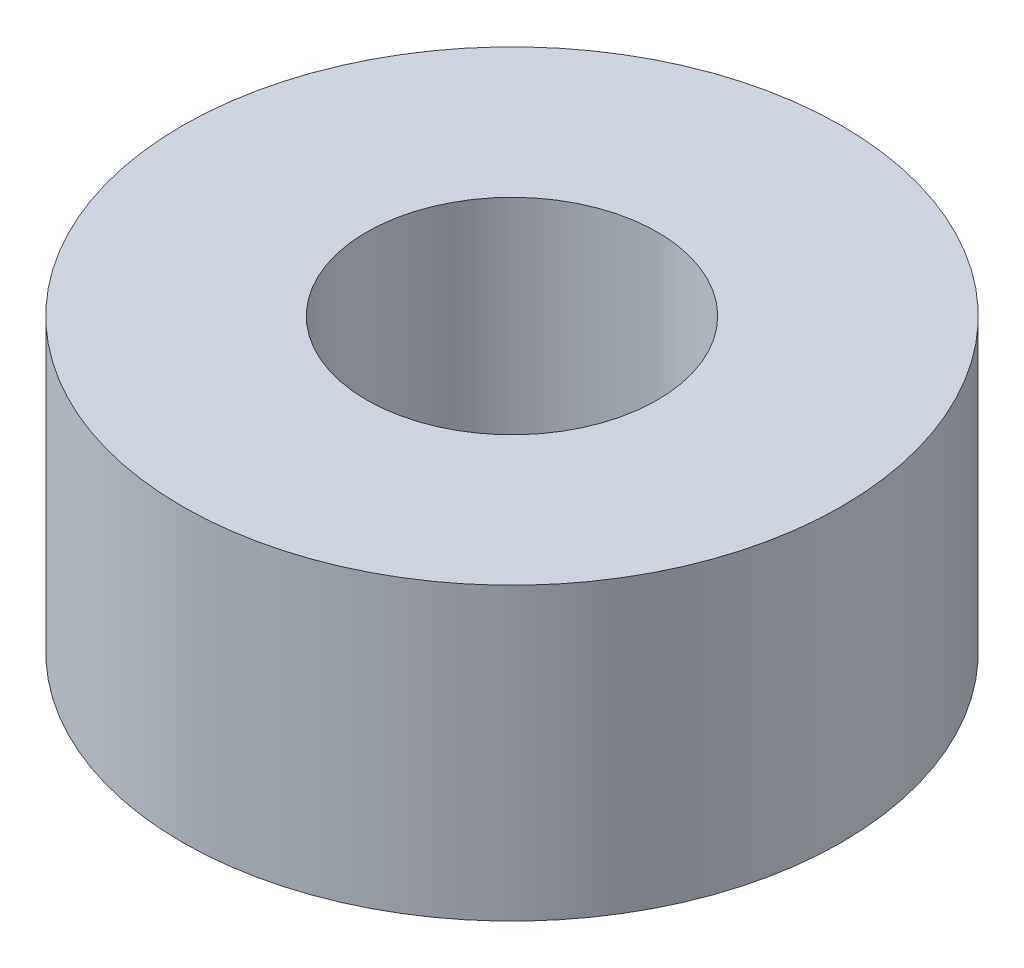
ISO-10303-21;
HEADER;
FILE_DESCRIPTION(('STEP AP214'),'2;1');
FILE_NAME('part.step','',(''),(''),'','','');
FILE_SCHEMA(('AUTOMOTIVE_DESIGN { 1 0 10303 214 1 1 1 1 }'));
ENDSEC;
DATA;
#1=APPLICATION_CONTEXT('core data for automotive mechanical design processes');
#2=APPLICATION_PROTOCOL_DEFINITION('international standard','automotive_design',2000,#1);
#3=PRODUCT_CONTEXT('',#1,'mechanical');
#4=PRODUCT('Part','Part','',(#3));
#5=PRODUCT_RELATED_PRODUCT_CATEGORY('part','',(#4));
#6=PRODUCT_DEFINITION_FORMATION('','',#4);
#7=PRODUCT_DEFINITION_CONTEXT('part definition',#1,'design');
#8=PRODUCT_DEFINITION('design','',#6,#7);
#9=PRODUCT_DEFINITION_SHAPE('','',#8);
#10=(LENGTH_UNIT() NAMED_UNIT(*) SI_UNIT(.MILLI.,.METRE.));
#11=(NAMED_UNIT(*) PLANE_ANGLE_UNIT() SI_UNIT($,.RADIAN.));
#12=(NAMED_UNIT(*) SI_UNIT($,.STERADIAN.) SOLID_ANGLE_UNIT());
#13=UNCERTAINTY_MEASURE_WITH_UNIT(LENGTH_MEASURE(1.E-05),#10,'distance_accuracy_value','');
#14=(GEOMETRIC_REPRESENTATION_CONTEXT(3) GLOBAL_UNCERTAINTY_ASSIGNED_CONTEXT((#13)) GLOBAL_UNIT_ASSIGNED_CONTEXT((#10,
#11,#12)) REPRESENTATION_CONTEXT('',''));
#15=CARTESIAN_POINT('',(0.,0.,0.));
#16=DIRECTION('',(0.,0.,1.));
#17=DIRECTION('',(1.,0.,0.));
#18=AXIS2_PLACEMENT_3D('',#15,#16,#17);
#19=CARTESIAN_POINT('',(0.,3.,0.));
#20=DIRECTION('',(0.,1.,0.));
#21=DIRECTION('',(0.,0.,1.));
#22=AXIS2_PLACEMENT_3D('',#19,#20,#21);
#23=PLANE('',#22);
#24=CARTESIAN_POINT('',(0.,3.,0.));
#25=DIRECTION('',(0.,1.,0.));
#26=DIRECTION('',(0.,0.,1.));
#27=AXIS2_PLACEMENT_3D('',#24,#25,#26);
#28=CIRCLE('',#27,3.4);
#29=CARTESIAN_POINT('',(0.,3.,3.4));
#30=VERTEX_POINT('',#29);
#31=EDGE_CURVE('E10',#30,#30,#28,.T.);
#32=ORIENTED_EDGE('',*,*,#31,.T.);
#33=EDGE_LOOP('',(#32));
#34=FACE_BOUND('',#33,.T.);
#35=CARTESIAN_POINT('',(0.,3.,0.));
#36=DIRECTION('',(0.,1.,0.));
#37=DIRECTION('',(0.,0.,1.));
#38=AXIS2_PLACEMENT_3D('',#35,#36,#37);
#39=CIRCLE('',#38,1.5);
#40=CARTESIAN_POINT('',(0.,3.,1.5));
#41=VERTEX_POINT('',#40);
#42=EDGE_CURVE('E43',#41,#41,#39,.T.);
#43=ORIENTED_EDGE('',*,*,#42,.F.);
#44=EDGE_LOOP('',(#43));
#45=FACE_BOUND('',#44,.T.);
#46=ADVANCED_FACE('F32',(#34,#45),#23,.T.);
#47=CARTESIAN_POINT('',(0.,0.,0.));
#48=DIRECTION('',(0.,1.,0.));
#49=DIRECTION('',(0.,0.,1.));
#50=AXIS2_PLACEMENT_3D('',#47,#48,#49);
#51=PLANE('',#50);
#52=CARTESIAN_POINT('',(0.,0.,0.));
#53=DIRECTION('',(0.,1.,0.));
#54=DIRECTION('',(0.,0.,1.));
#55=AXIS2_PLACEMENT_3D('',#52,#53,#54);
#56=CIRCLE('',#55,3.4);
#57=CARTESIAN_POINT('',(0.,0.,3.4));
#58=VERTEX_POINT('',#57);
#59=EDGE_CURVE('E36',#58,#58,#56,.T.);
#60=ORIENTED_EDGE('',*,*,#59,.F.);
#61=EDGE_LOOP('',(#60));
#62=FACE_BOUND('',#61,.T.);
#63=CARTESIAN_POINT('',(0.,0.,0.));
#64=DIRECTION('',(0.,1.,0.));
#65=DIRECTION('',(0.,0.,1.));
#66=AXIS2_PLACEMENT_3D('',#63,#64,#65);
#67=CIRCLE('',#66,1.5);
#68=CARTESIAN_POINT('',(0.,0.,1.5));
#69=VERTEX_POINT('',#68);
#70=EDGE_CURVE('E45',#69,#69,#67,.T.);
#71=ORIENTED_EDGE('',*,*,#70,.T.);
#72=EDGE_LOOP('',(#71));
#73=FACE_BOUND('',#72,.T.);
#74=ADVANCED_FACE('F55',(#62,#73),#51,.F.);
#75=CARTESIAN_POINT('',(0.,3.,0.));
#76=DIRECTION('',(0.,-1.,0.));
#77=DIRECTION('',(0.,0.,-1.));
#78=AXIS2_PLACEMENT_3D('',#75,#76,#77);
#79=CYLINDRICAL_SURFACE('',#78,3.4);
#80=ORIENTED_EDGE('',*,*,#31,.F.);
#81=EDGE_LOOP('',(#80));
#82=FACE_BOUND('',#81,.T.);
#83=ORIENTED_EDGE('',*,*,#59,.T.);
#84=EDGE_LOOP('',(#83));
#85=FACE_BOUND('',#84,.T.);
#86=ADVANCED_FACE('F34',(#82,#85),#79,.T.);
#87=CARTESIAN_POINT('',(0.,3.,0.));
#88=DIRECTION('',(0.,-1.,0.));
#89=DIRECTION('',(0.,0.,-1.));
#90=AXIS2_PLACEMENT_3D('',#87,#88,#89);
#91=CYLINDRICAL_SURFACE('',#90,1.5);
#92=ORIENTED_EDGE('',*,*,#42,.T.);
#93=EDGE_LOOP('',(#92));
#94=FACE_BOUND('',#93,.T.);
#95=ORIENTED_EDGE('',*,*,#70,.F.);
#96=EDGE_LOOP('',(#95));
#97=FACE_BOUND('',#96,.T.);
#98=ADVANCED_FACE('F51',(#94,#97),#91,.F.);
#99=CLOSED_SHELL('',(#46,#74,#86,#98));
#100=MANIFOLD_SOLID_BREP('B2',#99);
#101=ADVANCED_BREP_SHAPE_REPRESENTATION('',(#18,#100),#14);
#102=SHAPE_DEFINITION_REPRESENTATION(#9,#101);
ENDSEC;
END-ISO-10303-21;
